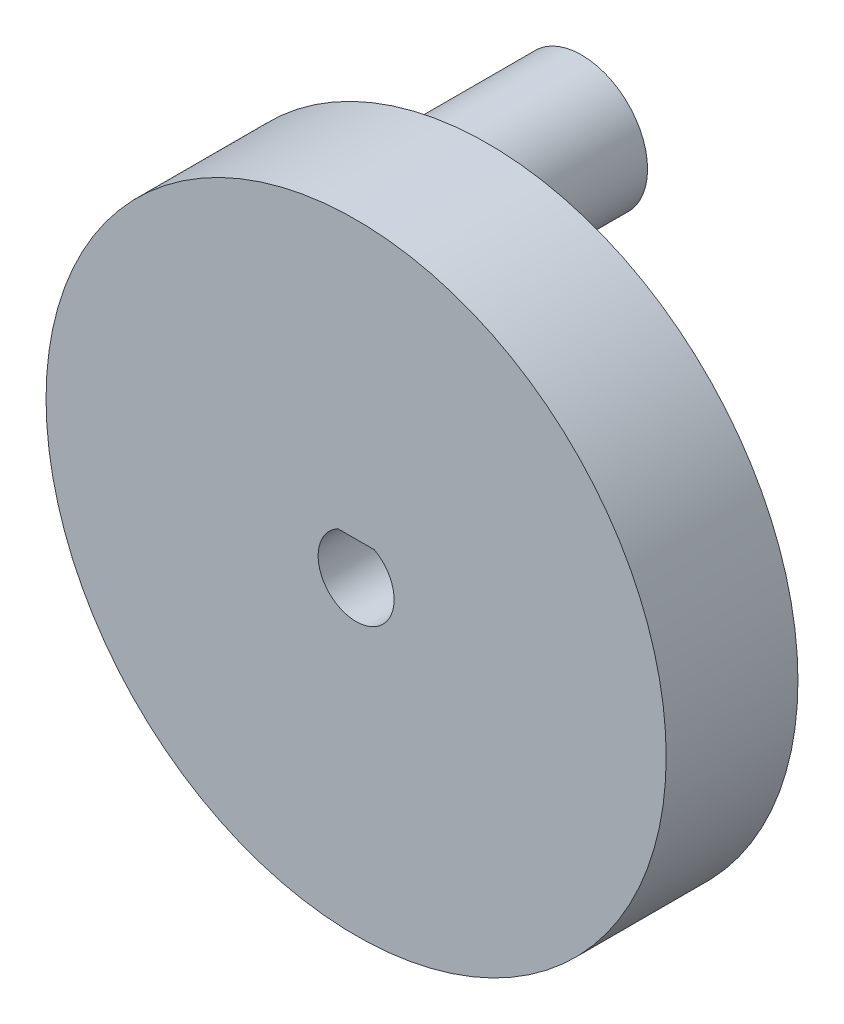
ISO-10303-21;
HEADER;
FILE_DESCRIPTION(('STEP AP214'),'2;1');
FILE_NAME('part.step','',(''),(''),'','','');
FILE_SCHEMA(('AUTOMOTIVE_DESIGN { 1 0 10303 214 1 1 1 1 }'));
ENDSEC;
DATA;
#1=APPLICATION_CONTEXT('core data for automotive mechanical design processes');
#2=APPLICATION_PROTOCOL_DEFINITION('international standard','automotive_design',2000,#1);
#3=PRODUCT_CONTEXT('',#1,'mechanical');
#4=PRODUCT('Part','Part','',(#3));
#5=PRODUCT_RELATED_PRODUCT_CATEGORY('part','',(#4));
#6=PRODUCT_DEFINITION_FORMATION('','',#4);
#7=PRODUCT_DEFINITION_CONTEXT('part definition',#1,'design');
#8=PRODUCT_DEFINITION('design','',#6,#7);
#9=PRODUCT_DEFINITION_SHAPE('','',#8);
#10=(LENGTH_UNIT() NAMED_UNIT(*) SI_UNIT(.MILLI.,.METRE.));
#11=(NAMED_UNIT(*) PLANE_ANGLE_UNIT() SI_UNIT($,.RADIAN.));
#12=(NAMED_UNIT(*) SI_UNIT($,.STERADIAN.) SOLID_ANGLE_UNIT());
#13=UNCERTAINTY_MEASURE_WITH_UNIT(LENGTH_MEASURE(1.E-05),#10,'distance_accuracy_value','');
#14=(GEOMETRIC_REPRESENTATION_CONTEXT(3) GLOBAL_UNCERTAINTY_ASSIGNED_CONTEXT((#13)) GLOBAL_UNIT_ASSIGNED_CONTEXT((#10,
#11,#12)) REPRESENTATION_CONTEXT('',''));
#15=CARTESIAN_POINT('',(0.,0.,0.));
#16=DIRECTION('',(0.,0.,1.));
#17=DIRECTION('',(1.,0.,0.));
#18=AXIS2_PLACEMENT_3D('',#15,#16,#17);
#19=CARTESIAN_POINT('',(0.,0.,-8.5));
#20=DIRECTION('',(0.,0.,1.));
#21=DIRECTION('',(1.,0.,0.));
#22=AXIS2_PLACEMENT_3D('',#19,#20,#21);
#23=CYLINDRICAL_SURFACE('',#22,20.);
#24=CARTESIAN_POINT('',(0.,0.,-8.5));
#25=DIRECTION('',(0.,0.,1.));
#26=DIRECTION('',(1.,0.,0.));
#27=AXIS2_PLACEMENT_3D('',#24,#25,#26);
#28=CIRCLE('',#27,20.);
#29=CARTESIAN_POINT('',(20.,0.,-8.5));
#30=VERTEX_POINT('',#29);
#31=EDGE_CURVE('E84',#30,#30,#28,.T.);
#32=ORIENTED_EDGE('',*,*,#31,.T.);
#33=EDGE_LOOP('',(#32));
#34=FACE_BOUND('',#33,.T.);
#35=CARTESIAN_POINT('',(0.,0.,0.));
#36=DIRECTION('',(0.,0.,1.));
#37=DIRECTION('',(1.,0.,0.));
#38=AXIS2_PLACEMENT_3D('',#35,#36,#37);
#39=CIRCLE('',#38,20.);
#40=CARTESIAN_POINT('',(20.,0.,0.));
#41=VERTEX_POINT('',#40);
#42=EDGE_CURVE('E64',#41,#41,#39,.T.);
#43=ORIENTED_EDGE('',*,*,#42,.F.);
#44=EDGE_LOOP('',(#43));
#45=FACE_BOUND('',#44,.T.);
#46=ADVANCED_FACE('F33',(#34,#45),#23,.T.);
#47=CARTESIAN_POINT('',(0.,0.,-8.5));
#48=DIRECTION('',(0.,0.,1.));
#49=DIRECTION('',(1.,0.,0.));
#50=AXIS2_PLACEMENT_3D('',#47,#48,#49);
#51=PLANE('',#50);
#52=CARTESIAN_POINT('',(-8.95113150147861,8.72509282719888,-8.5));
#53=DIRECTION('',(0.,0.,1.));
#54=DIRECTION('',(1.,0.,0.));
#55=AXIS2_PLACEMENT_3D('',#52,#53,#54);
#56=CIRCLE('',#55,5.75000000000001);
#57=CARTESIAN_POINT('',(-3.2011315014786,8.72509282719888,-8.5));
#58=VERTEX_POINT('',#57);
#59=EDGE_CURVE('E11',#58,#58,#56,.T.);
#60=ORIENTED_EDGE('',*,*,#59,.T.);
#61=EDGE_LOOP('',(#60));
#62=FACE_BOUND('',#61,.T.);
#63=DIRECTION('',(-1.,0.,0.));
#64=VECTOR('',#63,1.);
#65=CARTESIAN_POINT('',(-1.17473401244707,2.15,-8.5));
#66=LINE('',#65,#64);
#67=CARTESIAN_POINT('',(1.17473401244707,2.15,-8.5));
#68=VERTEX_POINT('',#67);
#69=CARTESIAN_POINT('',(-1.17473401244707,2.15,-8.5));
#70=VERTEX_POINT('',#69);
#71=EDGE_CURVE('E80',#68,#70,#66,.T.);
#72=ORIENTED_EDGE('',*,*,#71,.T.);
#73=CARTESIAN_POINT('',(0.,0.,-8.5));
#74=DIRECTION('',(0.,0.,1.));
#75=DIRECTION('',(1.,0.,0.));
#76=AXIS2_PLACEMENT_3D('',#73,#74,#75);
#77=CIRCLE('',#76,2.45);
#78=EDGE_CURVE('E48',#70,#68,#77,.T.);
#79=ORIENTED_EDGE('',*,*,#78,.T.);
#80=EDGE_LOOP('',(#72,#79));
#81=FACE_BOUND('',#80,.T.);
#82=ORIENTED_EDGE('',*,*,#31,.F.);
#83=EDGE_LOOP('',(#82));
#84=FACE_BOUND('',#83,.T.);
#85=ADVANCED_FACE('F103',(#62,#81,#84),#51,.F.);
#86=CARTESIAN_POINT('',(0.,0.,0.));
#87=DIRECTION('',(0.,0.,1.));
#88=DIRECTION('',(1.,0.,0.));
#89=AXIS2_PLACEMENT_3D('',#86,#87,#88);
#90=PLANE('',#89);
#91=CARTESIAN_POINT('',(0.,0.,0.));
#92=DIRECTION('',(0.,0.,1.));
#93=DIRECTION('',(1.,0.,0.));
#94=AXIS2_PLACEMENT_3D('',#91,#92,#93);
#95=CIRCLE('',#94,2.45);
#96=CARTESIAN_POINT('',(-1.17473401244707,2.15,0.));
#97=VERTEX_POINT('',#96);
#98=CARTESIAN_POINT('',(1.17473401244707,2.15,0.));
#99=VERTEX_POINT('',#98);
#100=EDGE_CURVE('E53',#97,#99,#95,.T.);
#101=ORIENTED_EDGE('',*,*,#100,.F.);
#102=DIRECTION('',(-1.,0.,0.));
#103=VECTOR('',#102,1.);
#104=CARTESIAN_POINT('',(-1.17473401244707,2.15,0.));
#105=LINE('',#104,#103);
#106=EDGE_CURVE('E68',#99,#97,#105,.T.);
#107=ORIENTED_EDGE('',*,*,#106,.F.);
#108=EDGE_LOOP('',(#101,#107));
#109=FACE_BOUND('',#108,.T.);
#110=ORIENTED_EDGE('',*,*,#42,.T.);
#111=EDGE_LOOP('',(#110));
#112=FACE_BOUND('',#111,.T.);
#113=ADVANCED_FACE('F72',(#109,#112),#90,.T.);
#114=CARTESIAN_POINT('',(0.,0.,-8.5));
#115=DIRECTION('',(0.,0.,1.));
#116=DIRECTION('',(1.,0.,0.));
#117=AXIS2_PLACEMENT_3D('',#114,#115,#116);
#118=CYLINDRICAL_SURFACE('',#117,2.45);
#119=ORIENTED_EDGE('',*,*,#100,.T.);
#120=DIRECTION('',(0.,0.,1.));
#121=VECTOR('',#120,1.);
#122=CARTESIAN_POINT('',(1.17473401244707,2.15,-8.5));
#123=LINE('',#122,#121);
#124=EDGE_CURVE('E65',#68,#99,#123,.T.);
#125=ORIENTED_EDGE('',*,*,#124,.F.);
#126=ORIENTED_EDGE('',*,*,#78,.F.);
#127=DIRECTION('',(0.,0.,1.));
#128=VECTOR('',#127,1.);
#129=CARTESIAN_POINT('',(-1.17473401244707,2.15,-8.5));
#130=LINE('',#129,#128);
#131=EDGE_CURVE('E58',#70,#97,#130,.T.);
#132=ORIENTED_EDGE('',*,*,#131,.T.);
#133=EDGE_LOOP('',(#119,#125,#126,#132));
#134=FACE_BOUND('',#133,.T.);
#135=ADVANCED_FACE('F60',(#134),#118,.F.);
#136=CARTESIAN_POINT('',(-1.17473401244707,2.15,-8.5));
#137=DIRECTION('',(0.,1.,0.));
#138=DIRECTION('',(-1.,0.,0.));
#139=AXIS2_PLACEMENT_3D('',#136,#137,#138);
#140=PLANE('',#139);
#141=ORIENTED_EDGE('',*,*,#106,.T.);
#142=ORIENTED_EDGE('',*,*,#131,.F.);
#143=ORIENTED_EDGE('',*,*,#71,.F.);
#144=ORIENTED_EDGE('',*,*,#124,.T.);
#145=EDGE_LOOP('',(#141,#142,#143,#144));
#146=FACE_BOUND('',#145,.T.);
#147=ADVANCED_FACE('F69',(#146),#140,.F.);
#148=CARTESIAN_POINT('',(-8.95113150147861,8.72509282719888,-23.5));
#149=DIRECTION('',(0.,0.,-1.));
#150=DIRECTION('',(-1.,0.,0.));
#151=AXIS2_PLACEMENT_3D('',#148,#149,#150);
#152=PLANE('',#151);
#153=CARTESIAN_POINT('',(-8.95113150147861,8.72509282719888,-23.5));
#154=DIRECTION('',(0.,0.,-1.));
#155=DIRECTION('',(-1.,0.,0.));
#156=AXIS2_PLACEMENT_3D('',#153,#154,#155);
#157=CIRCLE('',#156,4.25);
#158=CARTESIAN_POINT('',(-13.2011315014786,8.72509282719888,-23.5));
#159=VERTEX_POINT('',#158);
#160=EDGE_CURVE('E74',#159,#159,#157,.T.);
#161=ORIENTED_EDGE('',*,*,#160,.T.);
#162=EDGE_LOOP('',(#161));
#163=FACE_BOUND('',#162,.T.);
#164=CARTESIAN_POINT('',(-8.95113150147861,8.72509282719888,-23.5));
#165=DIRECTION('',(0.,0.,-1.));
#166=DIRECTION('',(-1.,0.,0.));
#167=AXIS2_PLACEMENT_3D('',#164,#165,#166);
#168=CIRCLE('',#167,1.5);
#169=CARTESIAN_POINT('',(-10.4511315014786,8.72509282719888,-23.5));
#170=VERTEX_POINT('',#169);
#171=EDGE_CURVE('E77',#170,#170,#168,.T.);
#172=ORIENTED_EDGE('',*,*,#171,.F.);
#173=EDGE_LOOP('',(#172));
#174=FACE_BOUND('',#173,.T.);
#175=ADVANCED_FACE('F119',(#163,#174),#152,.T.);
#176=CARTESIAN_POINT('',(-8.95113150147861,8.72509282719888,-23.5));
#177=DIRECTION('',(0.,0.,1.));
#178=DIRECTION('',(1.,0.,0.));
#179=AXIS2_PLACEMENT_3D('',#176,#177,#178);
#180=CYLINDRICAL_SURFACE('',#179,4.25);
#181=CARTESIAN_POINT('',(-8.95113150147861,8.72509282719888,-9.75864944676594));
#182=DIRECTION('',(0.,0.,1.));
#183=DIRECTION('',(1.,0.,0.));
#184=AXIS2_PLACEMENT_3D('',#181,#182,#183);
#185=CIRCLE('',#184,4.25);
#186=CARTESIAN_POINT('',(-4.70113150147861,8.72509282719888,-9.75864944676594));
#187=VERTEX_POINT('',#186);
#188=EDGE_CURVE('E41',#187,#187,#185,.F.);
#189=ORIENTED_EDGE('',*,*,#188,.T.);
#190=EDGE_LOOP('',(#189));
#191=FACE_BOUND('',#190,.T.);
#192=ORIENTED_EDGE('',*,*,#160,.F.);
#193=EDGE_LOOP('',(#192));
#194=FACE_BOUND('',#193,.T.);
#195=ADVANCED_FACE('F91',(#191,#194),#180,.T.);
#196=CARTESIAN_POINT('',(-8.95113150147861,8.72509282719888,-23.5));
#197=DIRECTION('',(0.,0.,1.));
#198=DIRECTION('',(1.,0.,0.));
#199=AXIS2_PLACEMENT_3D('',#196,#197,#198);
#200=CYLINDRICAL_SURFACE('',#199,1.5);
#201=ORIENTED_EDGE('',*,*,#171,.T.);
#202=EDGE_LOOP('',(#201));
#203=FACE_BOUND('',#202,.T.);
#204=CARTESIAN_POINT('',(-8.95113150147861,8.72509282719888,-8.5));
#205=DIRECTION('',(0.,0.,-1.));
#206=DIRECTION('',(-1.,0.,0.));
#207=AXIS2_PLACEMENT_3D('',#204,#205,#206);
#208=CIRCLE('',#207,1.5);
#209=CARTESIAN_POINT('',(-10.4511315014786,8.72509282719888,-8.5));
#210=VERTEX_POINT('',#209);
#211=EDGE_CURVE('E134',#210,#210,#208,.T.);
#212=ORIENTED_EDGE('',*,*,#211,.F.);
#213=EDGE_LOOP('',(#212));
#214=FACE_BOUND('',#213,.T.);
#215=ADVANCED_FACE('F100',(#203,#214),#200,.F.);
#216=ORIENTED_EDGE('',*,*,#211,.T.);
#217=EDGE_LOOP('',(#216));
#218=FACE_BOUND('',#217,.T.);
#219=ADVANCED_FACE('F95',(#218),#51,.F.);
#220=CARTESIAN_POINT('',(-8.95113150147861,8.72509282719888,-9.75864944676594));
#221=DIRECTION('',(0.,0.,1.));
#222=DIRECTION('',(1.,0.,0.));
#223=AXIS2_PLACEMENT_3D('',#220,#221,#222);
#224=CONICAL_SURFACE('',#223,4.25,0.872664625997162);
#225=ORIENTED_EDGE('',*,*,#59,.F.);
#226=EDGE_LOOP('',(#225));
#227=FACE_BOUND('',#226,.T.);
#228=ORIENTED_EDGE('',*,*,#188,.F.);
#229=EDGE_LOOP('',(#228));
#230=FACE_BOUND('',#229,.T.);
#231=ADVANCED_FACE('F35',(#227,#230),#224,.T.);
#232=CLOSED_SHELL('',(#46,#85,#113,#135,#147,#175,#195,#215,#219,#231));
#233=MANIFOLD_SOLID_BREP('B2',#232);
#234=ADVANCED_BREP_SHAPE_REPRESENTATION('',(#18,#233),#14);
#235=SHAPE_DEFINITION_REPRESENTATION(#9,#234);
ENDSEC;
END-ISO-10303-21;
